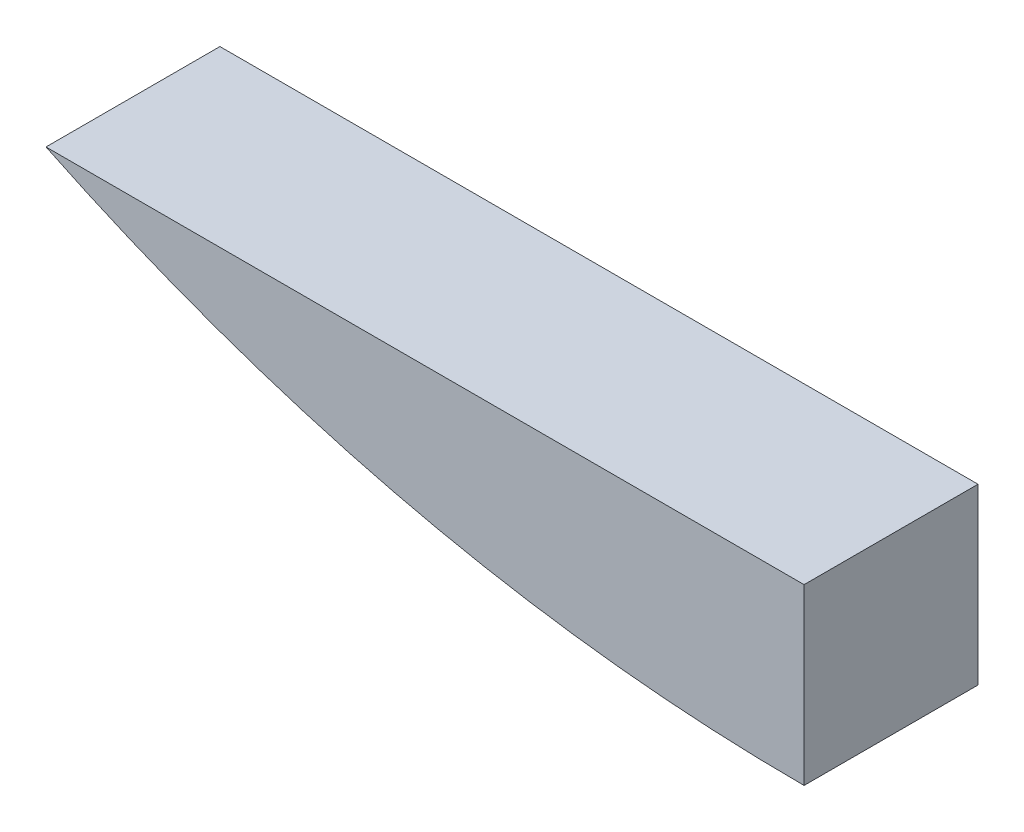
ISO-10303-21;
HEADER;
FILE_DESCRIPTION(('STEP AP214'),'2;1');
FILE_NAME('part.step','',(''),(''),'','','');
FILE_SCHEMA(('AUTOMOTIVE_DESIGN { 1 0 10303 214 1 1 1 1 }'));
ENDSEC;
DATA;
#1=APPLICATION_CONTEXT('core data for automotive mechanical design processes');
#2=APPLICATION_PROTOCOL_DEFINITION('international standard','automotive_design',2000,#1);
#3=PRODUCT_CONTEXT('',#1,'mechanical');
#4=PRODUCT('Part','Part','',(#3));
#5=PRODUCT_RELATED_PRODUCT_CATEGORY('part','',(#4));
#6=PRODUCT_DEFINITION_FORMATION('','',#4);
#7=PRODUCT_DEFINITION_CONTEXT('part definition',#1,'design');
#8=PRODUCT_DEFINITION('design','',#6,#7);
#9=PRODUCT_DEFINITION_SHAPE('','',#8);
#10=(LENGTH_UNIT() NAMED_UNIT(*) SI_UNIT(.MILLI.,.METRE.));
#11=(NAMED_UNIT(*) PLANE_ANGLE_UNIT() SI_UNIT($,.RADIAN.));
#12=(NAMED_UNIT(*) SI_UNIT($,.STERADIAN.) SOLID_ANGLE_UNIT());
#13=UNCERTAINTY_MEASURE_WITH_UNIT(LENGTH_MEASURE(1.E-05),#10,'distance_accuracy_value','');
#14=(GEOMETRIC_REPRESENTATION_CONTEXT(3) GLOBAL_UNCERTAINTY_ASSIGNED_CONTEXT((#13)) GLOBAL_UNIT_ASSIGNED_CONTEXT((#10,
#11,#12)) REPRESENTATION_CONTEXT('',''));
#15=CARTESIAN_POINT('',(0.,0.,0.));
#16=DIRECTION('',(0.,0.,1.));
#17=DIRECTION('',(1.,0.,0.));
#18=AXIS2_PLACEMENT_3D('',#15,#16,#17);
#19=CARTESIAN_POINT('',(0.,-45.,0.));
#20=DIRECTION('',(0.,1.,0.));
#21=DIRECTION('',(0.,0.,1.));
#22=AXIS2_PLACEMENT_3D('',#19,#20,#21);
#23=PLANE('',#22);
#24=DIRECTION('',(0.,0.,-1.));
#25=VECTOR('',#24,1.);
#26=CARTESIAN_POINT('',(-502.733741957931,-45.,0.));
#27=LINE('',#26,#25);
#28=CARTESIAN_POINT('',(-502.733741957931,-45.,5.));
#29=VERTEX_POINT('',#28);
#30=CARTESIAN_POINT('',(-502.733741957931,-45.,0.));
#31=VERTEX_POINT('',#30);
#32=EDGE_CURVE('E11',#29,#31,#27,.T.);
#33=ORIENTED_EDGE('',*,*,#32,.T.);
#34=DIRECTION('',(-1.,0.,0.));
#35=VECTOR('',#34,1.);
#36=CARTESIAN_POINT('',(-502.733741957931,-45.,0.));
#37=LINE('',#36,#35);
#38=CARTESIAN_POINT('',(-524.528236675635,-45.,0.));
#39=VERTEX_POINT('',#38);
#40=EDGE_CURVE('E37',#31,#39,#37,.T.);
#41=ORIENTED_EDGE('',*,*,#40,.T.);
#42=DIRECTION('',(0.,0.,-1.));
#43=VECTOR('',#42,1.);
#44=CARTESIAN_POINT('',(-524.528236675635,-45.,80.));
#45=LINE('',#44,#43);
#46=CARTESIAN_POINT('',(-524.528236675635,-45.,5.));
#47=VERTEX_POINT('',#46);
#48=EDGE_CURVE('E42',#39,#47,#45,.F.);
#49=ORIENTED_EDGE('',*,*,#48,.T.);
#50=DIRECTION('',(-1.,0.,0.));
#51=VECTOR('',#50,1.);
#52=CARTESIAN_POINT('',(597.266258042068,-45.,5.));
#53=LINE('',#52,#51);
#54=EDGE_CURVE('E72',#29,#47,#53,.T.);
#55=ORIENTED_EDGE('',*,*,#54,.F.);
#56=EDGE_LOOP('',(#33,#41,#49,#55));
#57=FACE_BOUND('',#56,.T.);
#58=ADVANCED_FACE('F34',(#57),#23,.T.);
#59=CARTESIAN_POINT('',(597.266258042068,-45.,5.));
#60=DIRECTION('',(0.,0.,1.));
#61=DIRECTION('',(1.,0.,0.));
#62=AXIS2_PLACEMENT_3D('',#59,#60,#61);
#63=PLANE('',#62);
#64=DIRECTION('',(0.,1.,0.));
#65=VECTOR('',#64,1.);
#66=CARTESIAN_POINT('',(-502.733741957931,-45.,5.));
#67=LINE('',#66,#65);
#68=CARTESIAN_POINT('',(-502.733741957931,-50.,5.));
#69=VERTEX_POINT('',#68);
#70=EDGE_CURVE('E58',#69,#29,#67,.T.);
#71=ORIENTED_EDGE('',*,*,#70,.T.);
#72=ORIENTED_EDGE('',*,*,#54,.T.);
#73=CARTESIAN_POINT('',(-502.733741957931,0.,5.));
#74=DIRECTION('',(0.,0.,1.));
#75=DIRECTION('',(1.,0.,0.));
#76=AXIS2_PLACEMENT_3D('',#73,#74,#75);
#77=CIRCLE('',#76,50.);
#78=EDGE_CURVE('E70',#47,#69,#77,.T.);
#79=ORIENTED_EDGE('',*,*,#78,.T.);
#80=EDGE_LOOP('',(#71,#72,#79));
#81=FACE_BOUND('',#80,.T.);
#82=ADVANCED_FACE('F71',(#81),#63,.T.);
#83=CARTESIAN_POINT('',(-502.733741957931,0.,0.));
#84=DIRECTION('',(1.,0.,0.));
#85=DIRECTION('',(0.,0.,-1.));
#86=AXIS2_PLACEMENT_3D('',#83,#84,#85);
#87=PLANE('',#86);
#88=DIRECTION('',(0.,0.,-1.));
#89=VECTOR('',#88,1.);
#90=CARTESIAN_POINT('',(-502.733741957931,-50.,80.));
#91=LINE('',#90,#89);
#92=CARTESIAN_POINT('',(-502.733741957931,-50.,0.));
#93=VERTEX_POINT('',#92);
#94=EDGE_CURVE('E80',#69,#93,#91,.T.);
#95=ORIENTED_EDGE('',*,*,#94,.T.);
#96=DIRECTION('',(0.,1.,0.));
#97=VECTOR('',#96,1.);
#98=CARTESIAN_POINT('',(-502.733741957931,0.,0.));
#99=LINE('',#98,#97);
#100=EDGE_CURVE('E50',#93,#31,#99,.T.);
#101=ORIENTED_EDGE('',*,*,#100,.T.);
#102=ORIENTED_EDGE('',*,*,#32,.F.);
#103=ORIENTED_EDGE('',*,*,#70,.F.);
#104=EDGE_LOOP('',(#95,#101,#102,#103));
#105=FACE_BOUND('',#104,.T.);
#106=ADVANCED_FACE('F79',(#105),#87,.T.);
#107=CARTESIAN_POINT('',(-502.733741957931,0.,0.));
#108=DIRECTION('',(0.,0.,1.));
#109=DIRECTION('',(1.,0.,0.));
#110=AXIS2_PLACEMENT_3D('',#107,#108,#109);
#111=PLANE('',#110);
#112=ORIENTED_EDGE('',*,*,#40,.F.);
#113=ORIENTED_EDGE('',*,*,#100,.F.);
#114=CARTESIAN_POINT('',(-502.733741957931,0.,0.));
#115=DIRECTION('',(0.,0.,1.));
#116=DIRECTION('',(1.,0.,0.));
#117=AXIS2_PLACEMENT_3D('',#114,#115,#116);
#118=CIRCLE('',#117,50.);
#119=EDGE_CURVE('E77',#39,#93,#118,.T.);
#120=ORIENTED_EDGE('',*,*,#119,.F.);
#121=EDGE_LOOP('',(#112,#113,#120));
#122=FACE_BOUND('',#121,.T.);
#123=ADVANCED_FACE('F90',(#122),#111,.F.);
#124=CARTESIAN_POINT('',(-502.733741957931,0.,80.));
#125=DIRECTION('',(0.,0.,-1.));
#126=DIRECTION('',(-1.,0.,0.));
#127=AXIS2_PLACEMENT_3D('',#124,#125,#126);
#128=CYLINDRICAL_SURFACE('',#127,50.);
#129=ORIENTED_EDGE('',*,*,#48,.F.);
#130=ORIENTED_EDGE('',*,*,#119,.T.);
#131=ORIENTED_EDGE('',*,*,#94,.F.);
#132=ORIENTED_EDGE('',*,*,#78,.F.);
#133=EDGE_LOOP('',(#129,#130,#131,#132));
#134=FACE_BOUND('',#133,.T.);
#135=ADVANCED_FACE('F82',(#134),#128,.T.);
#136=CLOSED_SHELL('',(#58,#82,#106,#123,#135));
#137=MANIFOLD_SOLID_BREP('B2',#136);
#138=ADVANCED_BREP_SHAPE_REPRESENTATION('',(#18,#137),#14);
#139=SHAPE_DEFINITION_REPRESENTATION(#9,#138);
ENDSEC;
END-ISO-10303-21;
